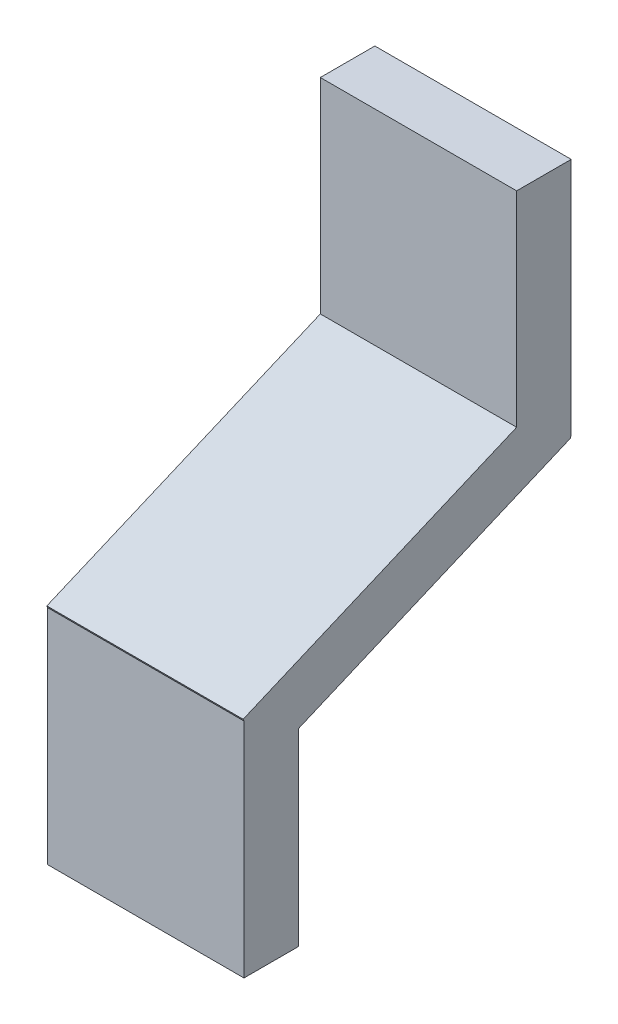
ISO-10303-21;
HEADER;
FILE_DESCRIPTION(('STEP AP214'),'2;1');
FILE_NAME('part.step','',(''),(''),'','','');
FILE_SCHEMA(('AUTOMOTIVE_DESIGN { 1 0 10303 214 1 1 1 1 }'));
ENDSEC;
DATA;
#1=APPLICATION_CONTEXT('core data for automotive mechanical design processes');
#2=APPLICATION_PROTOCOL_DEFINITION('international standard','automotive_design',2000,#1);
#3=PRODUCT_CONTEXT('',#1,'mechanical');
#4=PRODUCT('Part','Part','',(#3));
#5=PRODUCT_RELATED_PRODUCT_CATEGORY('part','',(#4));
#6=PRODUCT_DEFINITION_FORMATION('','',#4);
#7=PRODUCT_DEFINITION_CONTEXT('part definition',#1,'design');
#8=PRODUCT_DEFINITION('design','',#6,#7);
#9=PRODUCT_DEFINITION_SHAPE('','',#8);
#10=(LENGTH_UNIT() NAMED_UNIT(*) SI_UNIT(.MILLI.,.METRE.));
#11=(NAMED_UNIT(*) PLANE_ANGLE_UNIT() SI_UNIT($,.RADIAN.));
#12=(NAMED_UNIT(*) SI_UNIT($,.STERADIAN.) SOLID_ANGLE_UNIT());
#13=UNCERTAINTY_MEASURE_WITH_UNIT(LENGTH_MEASURE(1.E-05),#10,'distance_accuracy_value','');
#14=(GEOMETRIC_REPRESENTATION_CONTEXT(3) GLOBAL_UNCERTAINTY_ASSIGNED_CONTEXT((#13)) GLOBAL_UNIT_ASSIGNED_CONTEXT((#10,
#11,#12)) REPRESENTATION_CONTEXT('',''));
#15=CARTESIAN_POINT('',(0.,0.,0.));
#16=DIRECTION('',(0.,0.,1.));
#17=DIRECTION('',(1.,0.,0.));
#18=AXIS2_PLACEMENT_3D('',#15,#16,#17);
#19=CARTESIAN_POINT('',(7.42,11.,0.5));
#20=DIRECTION('',(0.,0.,1.));
#21=DIRECTION('',(1.,0.,0.));
#22=AXIS2_PLACEMENT_3D('',#19,#20,#21);
#23=PLANE('',#22);
#24=DIRECTION('',(1.,0.,0.));
#25=VECTOR('',#24,1.);
#26=CARTESIAN_POINT('',(7.42,11.3461054439247,0.500000000000314));
#27=LINE('',#26,#25);
#28=CARTESIAN_POINT('',(7.780000014305,11.3461054439242,0.500000000000105));
#29=VERTEX_POINT('',#28);
#30=CARTESIAN_POINT('',(7.42,11.3461054439243,0.500000000000105));
#31=VERTEX_POINT('',#30);
#32=EDGE_CURVE('E148',#29,#31,#27,.F.);
#33=ORIENTED_EDGE('',*,*,#32,.F.);
#34=DIRECTION('',(0.,1.,0.));
#35=VECTOR('',#34,1.);
#36=CARTESIAN_POINT('',(7.780000014305,11.65,0.5));
#37=LINE('',#36,#35);
#38=CARTESIAN_POINT('',(7.780000014305,11.,0.5));
#39=VERTEX_POINT('',#38);
#40=EDGE_CURVE('E154',#39,#29,#37,.T.);
#41=ORIENTED_EDGE('',*,*,#40,.F.);
#42=DIRECTION('',(1.,0.,0.));
#43=VECTOR('',#42,1.);
#44=CARTESIAN_POINT('',(7.42,11.,0.5));
#45=LINE('',#44,#43);
#46=CARTESIAN_POINT('',(7.42,11.,0.5));
#47=VERTEX_POINT('',#46);
#48=EDGE_CURVE('E135',#39,#47,#45,.F.);
#49=ORIENTED_EDGE('',*,*,#48,.T.);
#50=DIRECTION('',(0.,1.,0.));
#51=VECTOR('',#50,1.);
#52=CARTESIAN_POINT('',(7.42,11.65,0.5));
#53=LINE('',#52,#51);
#54=EDGE_CURVE('E182',#47,#31,#53,.T.);
#55=ORIENTED_EDGE('',*,*,#54,.T.);
#56=EDGE_LOOP('',(#33,#41,#49,#55));
#57=FACE_BOUND('',#56,.T.);
#58=ADVANCED_FACE('F17',(#57),#23,.F.);
#59=CARTESIAN_POINT('',(7.42,11.557949520001,0.0009268707435867));
#60=DIRECTION('',(0.,-0.920504786278108,-0.390731286742046));
#61=DIRECTION('',(0.,0.390731286742046,-0.920504786278108));
#62=AXIS2_PLACEMENT_3D('',#59,#60,#61);
#63=PLANE('',#62);
#64=DIRECTION('',(0.,0.39073128674346,-0.920504786277508));
#65=VECTOR('',#64,1.);
#66=CARTESIAN_POINT('',(7.780000014305,11.346105443924,0.5));
#67=LINE('',#66,#65);
#68=CARTESIAN_POINT('',(7.780000014305,11.557949520001,0.000926870743687995));
#69=VERTEX_POINT('',#68);
#70=EDGE_CURVE('E151',#29,#69,#67,.T.);
#71=ORIENTED_EDGE('',*,*,#70,.F.);
#72=ORIENTED_EDGE('',*,*,#32,.T.);
#73=DIRECTION('',(0.,0.39073128674346,-0.920504786277508));
#74=VECTOR('',#73,1.);
#75=CARTESIAN_POINT('',(7.42,11.346105443924,0.5));
#76=LINE('',#75,#74);
#77=CARTESIAN_POINT('',(7.42,11.557949520001,0.000926870743697318));
#78=VERTEX_POINT('',#77);
#79=EDGE_CURVE('E178',#31,#78,#76,.T.);
#80=ORIENTED_EDGE('',*,*,#79,.T.);
#81=DIRECTION('',(1.,0.,0.));
#82=VECTOR('',#81,1.);
#83=CARTESIAN_POINT('',(7.42,11.557949520001,0.000926870743744277));
#84=LINE('',#83,#82);
#85=EDGE_CURVE('E145',#78,#69,#84,.T.);
#86=ORIENTED_EDGE('',*,*,#85,.T.);
#87=EDGE_LOOP('',(#71,#72,#80,#86));
#88=FACE_BOUND('',#87,.T.);
#89=ADVANCED_FACE('F242',(#88),#63,.T.);
#90=CARTESIAN_POINT('',(7.42,11.65,0.04));
#91=DIRECTION('',(0.,-0.390731286742046,0.920504786278108));
#92=DIRECTION('',(0.,-0.920504786278108,-0.390731286742046));
#93=AXIS2_PLACEMENT_3D('',#90,#91,#92);
#94=PLANE('',#93);
#95=DIRECTION('',(0.,0.920504786259231,0.390731286786518));
#96=VECTOR('',#95,1.);
#97=CARTESIAN_POINT('',(7.42,11.557949520001,0.00092687074366));
#98=LINE('',#97,#96);
#99=CARTESIAN_POINT('',(7.42,11.56,0.001797248280528));
#100=VERTEX_POINT('',#99);
#101=EDGE_CURVE('E123',#78,#100,#98,.T.);
#102=ORIENTED_EDGE('',*,*,#101,.T.);
#103=DIRECTION('',(1.,0.,0.));
#104=VECTOR('',#103,1.);
#105=CARTESIAN_POINT('',(7.42,11.56,0.001797248280528));
#106=LINE('',#105,#104);
#107=CARTESIAN_POINT('',(7.780000014305,11.56,0.001797248280528));
#108=VERTEX_POINT('',#107);
#109=EDGE_CURVE('E97',#100,#108,#106,.T.);
#110=ORIENTED_EDGE('',*,*,#109,.T.);
#111=DIRECTION('',(0.,0.920504786259231,0.390731286786518));
#112=VECTOR('',#111,1.);
#113=CARTESIAN_POINT('',(7.780000014305,11.557949520001,0.00092687074366));
#114=LINE('',#113,#112);
#115=EDGE_CURVE('E153',#69,#108,#114,.T.);
#116=ORIENTED_EDGE('',*,*,#115,.F.);
#117=ORIENTED_EDGE('',*,*,#85,.F.);
#118=EDGE_LOOP('',(#102,#110,#116,#117));
#119=FACE_BOUND('',#118,.T.);
#120=ADVANCED_FACE('F243',(#119),#94,.F.);
#121=CARTESIAN_POINT('',(7.42,11.56,0.));
#122=DIRECTION('',(0.,1.,0.));
#123=DIRECTION('',(0.,0.,1.));
#124=AXIS2_PLACEMENT_3D('',#121,#122,#123);
#125=PLANE('',#124);
#126=ORIENTED_EDGE('',*,*,#109,.F.);
#127=DIRECTION('',(0.,0.,1.));
#128=VECTOR('',#127,1.);
#129=CARTESIAN_POINT('',(7.42,11.56,0.));
#130=LINE('',#129,#128);
#131=CARTESIAN_POINT('',(7.42,11.56,0.));
#132=VERTEX_POINT('',#131);
#133=EDGE_CURVE('E20',#100,#132,#130,.F.);
#134=ORIENTED_EDGE('',*,*,#133,.T.);
#135=DIRECTION('',(1.,0.,0.));
#136=VECTOR('',#135,1.);
#137=CARTESIAN_POINT('',(7.42,11.56,0.));
#138=LINE('',#137,#136);
#139=CARTESIAN_POINT('',(7.780000014305,11.56,0.));
#140=VERTEX_POINT('',#139);
#141=EDGE_CURVE('E104',#132,#140,#138,.T.);
#142=ORIENTED_EDGE('',*,*,#141,.T.);
#143=DIRECTION('',(0.,0.,-1.));
#144=VECTOR('',#143,1.);
#145=CARTESIAN_POINT('',(7.780000014305,11.56,0.04));
#146=LINE('',#145,#144);
#147=EDGE_CURVE('E194',#108,#140,#146,.T.);
#148=ORIENTED_EDGE('',*,*,#147,.F.);
#149=EDGE_LOOP('',(#126,#134,#142,#148));
#150=FACE_BOUND('',#149,.T.);
#151=ADVANCED_FACE('F122',(#150),#125,.F.);
#152=CARTESIAN_POINT('',(7.42,11.56,0.));
#153=DIRECTION('',(0.,0.,1.));
#154=DIRECTION('',(1.,0.,0.));
#155=AXIS2_PLACEMENT_3D('',#152,#153,#154);
#156=PLANE('',#155);
#157=ORIENTED_EDGE('',*,*,#141,.F.);
#158=DIRECTION('',(0.,1.,0.));
#159=VECTOR('',#158,1.);
#160=CARTESIAN_POINT('',(7.42,11.65,0.));
#161=LINE('',#160,#159);
#162=CARTESIAN_POINT('',(7.42,11.999999997616,0.));
#163=VERTEX_POINT('',#162);
#164=EDGE_CURVE('E108',#132,#163,#161,.T.);
#165=ORIENTED_EDGE('',*,*,#164,.T.);
#166=DIRECTION('',(1.,0.,0.));
#167=VECTOR('',#166,1.);
#168=CARTESIAN_POINT('',(7.42,11.999999997616,0.));
#169=LINE('',#168,#167);
#170=CARTESIAN_POINT('',(7.780000014305,11.999999997616,0.));
#171=VERTEX_POINT('',#170);
#172=EDGE_CURVE('E110',#171,#163,#169,.F.);
#173=ORIENTED_EDGE('',*,*,#172,.F.);
#174=DIRECTION('',(0.,1.,0.));
#175=VECTOR('',#174,1.);
#176=CARTESIAN_POINT('',(7.780000014305,11.65,0.));
#177=LINE('',#176,#175);
#178=EDGE_CURVE('E109',#140,#171,#177,.T.);
#179=ORIENTED_EDGE('',*,*,#178,.F.);
#180=EDGE_LOOP('',(#157,#165,#173,#179));
#181=FACE_BOUND('',#180,.T.);
#182=ADVANCED_FACE('F106',(#181),#156,.F.);
#183=CARTESIAN_POINT('',(7.42,11.999999997616,0.));
#184=DIRECTION('',(0.,1.,0.));
#185=DIRECTION('',(0.,0.,1.));
#186=AXIS2_PLACEMENT_3D('',#183,#184,#185);
#187=PLANE('',#186);
#188=ORIENTED_EDGE('',*,*,#172,.T.);
#189=DIRECTION('',(0.,0.,-1.));
#190=VECTOR('',#189,1.);
#191=CARTESIAN_POINT('',(7.42,11.999999997616,0.04));
#192=LINE('',#191,#190);
#193=CARTESIAN_POINT('',(7.42,11.999999997616,0.10000000149));
#194=VERTEX_POINT('',#193);
#195=EDGE_CURVE('E120',#163,#194,#192,.F.);
#196=ORIENTED_EDGE('',*,*,#195,.T.);
#197=DIRECTION('',(1.,0.,0.));
#198=VECTOR('',#197,1.);
#199=CARTESIAN_POINT('',(7.42,11.999999997616,0.10000000149));
#200=LINE('',#199,#198);
#201=CARTESIAN_POINT('',(7.780000014305,11.999999997616,0.10000000149));
#202=VERTEX_POINT('',#201);
#203=EDGE_CURVE('E181',#202,#194,#200,.F.);
#204=ORIENTED_EDGE('',*,*,#203,.F.);
#205=DIRECTION('',(0.,0.,-1.));
#206=VECTOR('',#205,1.);
#207=CARTESIAN_POINT('',(7.780000014305,11.999999997616,0.04));
#208=LINE('',#207,#206);
#209=EDGE_CURVE('E140',#171,#202,#208,.F.);
#210=ORIENTED_EDGE('',*,*,#209,.F.);
#211=EDGE_LOOP('',(#188,#196,#204,#210));
#212=FACE_BOUND('',#211,.T.);
#213=ADVANCED_FACE('F271',(#212),#187,.T.);
#214=CARTESIAN_POINT('',(7.42,11.,0.60000000149));
#215=DIRECTION('',(0.,0.,1.));
#216=DIRECTION('',(1.,0.,0.));
#217=AXIS2_PLACEMENT_3D('',#214,#215,#216);
#218=PLANE('',#217);
#219=DIRECTION('',(0.,1.,0.));
#220=VECTOR('',#219,1.);
#221=CARTESIAN_POINT('',(7.780000014305,11.65,0.60000000149));
#222=LINE('',#221,#220);
#223=CARTESIAN_POINT('',(7.780000014305,11.408101447657,0.600000001490072));
#224=VERTEX_POINT('',#223);
#225=CARTESIAN_POINT('',(7.780000014305,11.,0.60000000149));
#226=VERTEX_POINT('',#225);
#227=EDGE_CURVE('E168',#224,#226,#222,.F.);
#228=ORIENTED_EDGE('',*,*,#227,.F.);
#229=DIRECTION('',(1.,0.,0.));
#230=VECTOR('',#229,1.);
#231=CARTESIAN_POINT('',(7.42,11.4081014476569,0.600000001490144));
#232=LINE('',#231,#230);
#233=CARTESIAN_POINT('',(7.42,11.408101447657,0.600000001490072));
#234=VERTEX_POINT('',#233);
#235=EDGE_CURVE('E124',#234,#224,#232,.T.);
#236=ORIENTED_EDGE('',*,*,#235,.F.);
#237=DIRECTION('',(0.,1.,0.));
#238=VECTOR('',#237,1.);
#239=CARTESIAN_POINT('',(7.42,11.65,0.60000000149));
#240=LINE('',#239,#238);
#241=CARTESIAN_POINT('',(7.42,11.,0.60000000149));
#242=VERTEX_POINT('',#241);
#243=EDGE_CURVE('E192',#234,#242,#240,.F.);
#244=ORIENTED_EDGE('',*,*,#243,.T.);
#245=DIRECTION('',(1.,0.,0.));
#246=VECTOR('',#245,1.);
#247=CARTESIAN_POINT('',(7.42,11.,0.60000000149));
#248=LINE('',#247,#246);
#249=EDGE_CURVE('E127',#242,#226,#248,.T.);
#250=ORIENTED_EDGE('',*,*,#249,.T.);
#251=EDGE_LOOP('',(#228,#236,#244,#250));
#252=FACE_BOUND('',#251,.T.);
#253=ADVANCED_FACE('F232',(#252),#218,.T.);
#254=CARTESIAN_POINT('',(7.42,11.,0.5));
#255=DIRECTION('',(0.,1.,0.));
#256=DIRECTION('',(0.,0.,1.));
#257=AXIS2_PLACEMENT_3D('',#254,#255,#256);
#258=PLANE('',#257);
#259=DIRECTION('',(0.,0.,-1.));
#260=VECTOR('',#259,1.);
#261=CARTESIAN_POINT('',(7.42,11.,0.04));
#262=LINE('',#261,#260);
#263=EDGE_CURVE('E187',#242,#47,#262,.T.);
#264=ORIENTED_EDGE('',*,*,#263,.T.);
#265=ORIENTED_EDGE('',*,*,#48,.F.);
#266=DIRECTION('',(0.,0.,-1.));
#267=VECTOR('',#266,1.);
#268=CARTESIAN_POINT('',(7.780000014305,11.,0.04));
#269=LINE('',#268,#267);
#270=EDGE_CURVE('E164',#226,#39,#269,.T.);
#271=ORIENTED_EDGE('',*,*,#270,.F.);
#272=ORIENTED_EDGE('',*,*,#249,.F.);
#273=EDGE_LOOP('',(#264,#265,#271,#272));
#274=FACE_BOUND('',#273,.T.);
#275=ADVANCED_FACE('F235',(#274),#258,.F.);
#276=CARTESIAN_POINT('',(7.42,11.411653909498,0.601507932798));
#277=DIRECTION('',(0.,-0.390731286742046,0.920504786278108));
#278=DIRECTION('',(0.,-0.920504786278108,-0.390731286742046));
#279=AXIS2_PLACEMENT_3D('',#276,#277,#278);
#280=PLANE('',#279);
#281=ORIENTED_EDGE('',*,*,#235,.T.);
#282=DIRECTION('',(0.,-0.920504786262243,-0.390731286779422));
#283=VECTOR('',#282,1.);
#284=CARTESIAN_POINT('',(7.780000014305,11.411653909498,0.601507932798));
#285=LINE('',#284,#283);
#286=CARTESIAN_POINT('',(7.780000014305,11.4116539094979,0.601507932797974));
#287=VERTEX_POINT('',#286);
#288=EDGE_CURVE('E227',#287,#224,#285,.T.);
#289=ORIENTED_EDGE('',*,*,#288,.F.);
#290=DIRECTION('',(1.,0.,0.));
#291=VECTOR('',#290,1.);
#292=CARTESIAN_POINT('',(7.42,11.4116539094978,0.601507932797897));
#293=LINE('',#292,#291);
#294=CARTESIAN_POINT('',(7.42,11.4116539094979,0.601507932797974));
#295=VERTEX_POINT('',#294);
#296=EDGE_CURVE('E167',#287,#295,#293,.F.);
#297=ORIENTED_EDGE('',*,*,#296,.T.);
#298=DIRECTION('',(0.,-0.920504786262243,-0.390731286779422));
#299=VECTOR('',#298,1.);
#300=CARTESIAN_POINT('',(7.42,11.411653909498,0.601507932798));
#301=LINE('',#300,#299);
#302=EDGE_CURVE('E175',#295,#234,#301,.T.);
#303=ORIENTED_EDGE('',*,*,#302,.T.);
#304=EDGE_LOOP('',(#281,#289,#297,#303));
#305=FACE_BOUND('',#304,.T.);
#306=ADVANCED_FACE('F210',(#305),#280,.T.);
#307=CARTESIAN_POINT('',(7.42,11.65,0.04));
#308=DIRECTION('',(1.,0.,0.));
#309=DIRECTION('',(0.,0.,-1.));
#310=AXIS2_PLACEMENT_3D('',#307,#308,#309);
#311=PLANE('',#310);
#312=ORIENTED_EDGE('',*,*,#54,.F.);
#313=ORIENTED_EDGE('',*,*,#263,.F.);
#314=ORIENTED_EDGE('',*,*,#243,.F.);
#315=ORIENTED_EDGE('',*,*,#302,.F.);
#316=DIRECTION('',(0.,0.390731286742046,-0.920504786278108));
#317=VECTOR('',#316,1.);
#318=CARTESIAN_POINT('',(7.42,11.65,0.04));
#319=LINE('',#318,#317);
#320=CARTESIAN_POINT('',(7.42,11.624531498221,0.100000001490019));
#321=VERTEX_POINT('',#320);
#322=EDGE_CURVE('E216',#295,#321,#319,.T.);
#323=ORIENTED_EDGE('',*,*,#322,.T.);
#324=DIRECTION('',(0.,1.,0.));
#325=VECTOR('',#324,1.);
#326=CARTESIAN_POINT('',(7.42,11.56,0.10000000149));
#327=LINE('',#326,#325);
#328=EDGE_CURVE('E161',#194,#321,#327,.F.);
#329=ORIENTED_EDGE('',*,*,#328,.F.);
#330=ORIENTED_EDGE('',*,*,#195,.F.);
#331=ORIENTED_EDGE('',*,*,#164,.F.);
#332=ORIENTED_EDGE('',*,*,#133,.F.);
#333=ORIENTED_EDGE('',*,*,#101,.F.);
#334=ORIENTED_EDGE('',*,*,#79,.F.);
#335=EDGE_LOOP('',(#312,#313,#314,#315,#323,#329,#330,#331,#332,#333,#334));
#336=FACE_BOUND('',#335,.T.);
#337=ADVANCED_FACE('F115',(#336),#311,.F.);
#338=CARTESIAN_POINT('',(7.42,11.56,0.10000000149));
#339=DIRECTION('',(0.,0.,1.));
#340=DIRECTION('',(1.,0.,0.));
#341=AXIS2_PLACEMENT_3D('',#338,#339,#340);
#342=PLANE('',#341);
#343=ORIENTED_EDGE('',*,*,#328,.T.);
#344=DIRECTION('',(1.,0.,0.));
#345=VECTOR('',#344,1.);
#346=CARTESIAN_POINT('',(7.42,11.6245314982212,0.100000001490075));
#347=LINE('',#346,#345);
#348=CARTESIAN_POINT('',(7.780000014305,11.624531498221,0.100000001490019));
#349=VERTEX_POINT('',#348);
#350=EDGE_CURVE('E26',#321,#349,#347,.T.);
#351=ORIENTED_EDGE('',*,*,#350,.T.);
#352=DIRECTION('',(0.,1.,0.));
#353=VECTOR('',#352,1.);
#354=CARTESIAN_POINT('',(7.780000014305,11.65,0.10000000149));
#355=LINE('',#354,#353);
#356=EDGE_CURVE('E34',#202,#349,#355,.F.);
#357=ORIENTED_EDGE('',*,*,#356,.F.);
#358=ORIENTED_EDGE('',*,*,#203,.T.);
#359=EDGE_LOOP('',(#343,#351,#357,#358));
#360=FACE_BOUND('',#359,.T.);
#361=ADVANCED_FACE('F257',(#360),#342,.T.);
#362=CARTESIAN_POINT('',(7.780000014305,11.65,0.04));
#363=DIRECTION('',(1.,0.,0.));
#364=DIRECTION('',(0.,0.,-1.));
#365=AXIS2_PLACEMENT_3D('',#362,#363,#364);
#366=PLANE('',#365);
#367=ORIENTED_EDGE('',*,*,#227,.T.);
#368=ORIENTED_EDGE('',*,*,#270,.T.);
#369=ORIENTED_EDGE('',*,*,#40,.T.);
#370=ORIENTED_EDGE('',*,*,#70,.T.);
#371=ORIENTED_EDGE('',*,*,#115,.T.);
#372=ORIENTED_EDGE('',*,*,#147,.T.);
#373=ORIENTED_EDGE('',*,*,#178,.T.);
#374=ORIENTED_EDGE('',*,*,#209,.T.);
#375=ORIENTED_EDGE('',*,*,#356,.T.);
#376=DIRECTION('',(0.,0.390731286742046,-0.920504786278108));
#377=VECTOR('',#376,1.);
#378=CARTESIAN_POINT('',(7.780000014305,11.65,0.04));
#379=LINE('',#378,#377);
#380=EDGE_CURVE('E11',#349,#287,#379,.F.);
#381=ORIENTED_EDGE('',*,*,#380,.T.);
#382=ORIENTED_EDGE('',*,*,#288,.T.);
#383=EDGE_LOOP('',(#367,#368,#369,#370,#371,#372,#373,#374,#375,#381,#382));
#384=FACE_BOUND('',#383,.T.);
#385=ADVANCED_FACE('F230',(#384),#366,.T.);
#386=CARTESIAN_POINT('',(7.42,11.65,0.04));
#387=DIRECTION('',(0.,-0.920504786278108,-0.390731286742046));
#388=DIRECTION('',(0.,0.390731286742046,-0.920504786278108));
#389=AXIS2_PLACEMENT_3D('',#386,#387,#388);
#390=PLANE('',#389);
#391=ORIENTED_EDGE('',*,*,#350,.F.);
#392=ORIENTED_EDGE('',*,*,#322,.F.);
#393=ORIENTED_EDGE('',*,*,#296,.F.);
#394=ORIENTED_EDGE('',*,*,#380,.F.);
#395=EDGE_LOOP('',(#391,#392,#393,#394));
#396=FACE_BOUND('',#395,.T.);
#397=ADVANCED_FACE('F220',(#396),#390,.F.);
#398=CLOSED_SHELL('',(#58,#89,#120,#151,#182,#213,#253,#275,#306,#337,#361,#385,#397));
#399=MANIFOLD_SOLID_BREP('B1',#398);
#400=ADVANCED_BREP_SHAPE_REPRESENTATION('',(#18,#399),#14);
#401=SHAPE_DEFINITION_REPRESENTATION(#9,#400);
ENDSEC;
END-ISO-10303-21;
